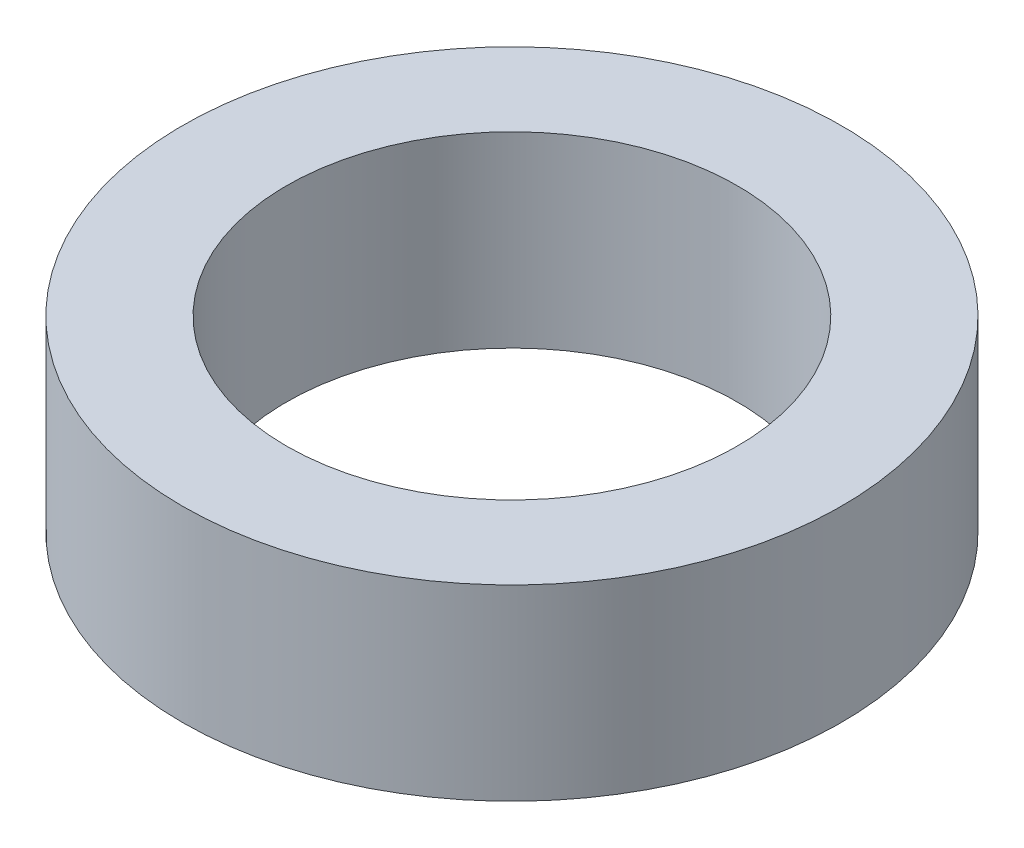
ISO-10303-21;
HEADER;
FILE_DESCRIPTION(('STEP AP214'),'2;1');
FILE_NAME('part.step','',(''),(''),'','','');
FILE_SCHEMA(('AUTOMOTIVE_DESIGN { 1 0 10303 214 1 1 1 1 }'));
ENDSEC;
DATA;
#1=APPLICATION_CONTEXT('core data for automotive mechanical design processes');
#2=APPLICATION_PROTOCOL_DEFINITION('international standard','automotive_design',2000,#1);
#3=PRODUCT_CONTEXT('',#1,'mechanical');
#4=PRODUCT('Part','Part','',(#3));
#5=PRODUCT_RELATED_PRODUCT_CATEGORY('part','',(#4));
#6=PRODUCT_DEFINITION_FORMATION('','',#4);
#7=PRODUCT_DEFINITION_CONTEXT('part definition',#1,'design');
#8=PRODUCT_DEFINITION('design','',#6,#7);
#9=PRODUCT_DEFINITION_SHAPE('','',#8);
#10=(LENGTH_UNIT() NAMED_UNIT(*) SI_UNIT(.MILLI.,.METRE.));
#11=(NAMED_UNIT(*) PLANE_ANGLE_UNIT() SI_UNIT($,.RADIAN.));
#12=(NAMED_UNIT(*) SI_UNIT($,.STERADIAN.) SOLID_ANGLE_UNIT());
#13=UNCERTAINTY_MEASURE_WITH_UNIT(LENGTH_MEASURE(1.E-05),#10,'distance_accuracy_value','');
#14=(GEOMETRIC_REPRESENTATION_CONTEXT(3) GLOBAL_UNCERTAINTY_ASSIGNED_CONTEXT((#13)) GLOBAL_UNIT_ASSIGNED_CONTEXT((#10,
#11,#12)) REPRESENTATION_CONTEXT('',''));
#15=CARTESIAN_POINT('',(0.,0.,0.));
#16=DIRECTION('',(0.,0.,1.));
#17=DIRECTION('',(1.,0.,0.));
#18=AXIS2_PLACEMENT_3D('',#15,#16,#17);
#19=CARTESIAN_POINT('',(0.,27.,0.));
#20=DIRECTION('',(0.,-1.,0.));
#21=DIRECTION('',(0.,0.,-1.));
#22=AXIS2_PLACEMENT_3D('',#19,#20,#21);
#23=CYLINDRICAL_SURFACE('',#22,47.5);
#24=CARTESIAN_POINT('',(0.,27.,0.));
#25=DIRECTION('',(0.,1.,0.));
#26=DIRECTION('',(0.,0.,1.));
#27=AXIS2_PLACEMENT_3D('',#24,#25,#26);
#28=CIRCLE('',#27,47.5);
#29=CARTESIAN_POINT('',(0.,27.,47.5));
#30=VERTEX_POINT('',#29);
#31=EDGE_CURVE('E10',#30,#30,#28,.T.);
#32=ORIENTED_EDGE('',*,*,#31,.F.);
#33=EDGE_LOOP('',(#32));
#34=FACE_BOUND('',#33,.T.);
#35=CARTESIAN_POINT('',(0.,0.,0.));
#36=DIRECTION('',(0.,1.,0.));
#37=DIRECTION('',(0.,0.,1.));
#38=AXIS2_PLACEMENT_3D('',#35,#36,#37);
#39=CIRCLE('',#38,47.5);
#40=CARTESIAN_POINT('',(0.,0.,47.5));
#41=VERTEX_POINT('',#40);
#42=EDGE_CURVE('E37',#41,#41,#39,.T.);
#43=ORIENTED_EDGE('',*,*,#42,.T.);
#44=EDGE_LOOP('',(#43));
#45=FACE_BOUND('',#44,.T.);
#46=ADVANCED_FACE('F40',(#34,#45),#23,.T.);
#47=CARTESIAN_POINT('',(0.,27.,0.));
#48=DIRECTION('',(0.,1.,0.));
#49=DIRECTION('',(0.,0.,1.));
#50=AXIS2_PLACEMENT_3D('',#47,#48,#49);
#51=PLANE('',#50);
#52=CARTESIAN_POINT('',(0.,27.,0.));
#53=DIRECTION('',(0.,1.,0.));
#54=DIRECTION('',(0.,0.,1.));
#55=AXIS2_PLACEMENT_3D('',#52,#53,#54);
#56=CIRCLE('',#55,32.5);
#57=CARTESIAN_POINT('',(0.,27.,32.5));
#58=VERTEX_POINT('',#57);
#59=EDGE_CURVE('E50',#58,#58,#56,.T.);
#60=ORIENTED_EDGE('',*,*,#59,.F.);
#61=EDGE_LOOP('',(#60));
#62=FACE_BOUND('',#61,.T.);
#63=ORIENTED_EDGE('',*,*,#31,.T.);
#64=EDGE_LOOP('',(#63));
#65=FACE_BOUND('',#64,.T.);
#66=ADVANCED_FACE('F59',(#62,#65),#51,.T.);
#67=CARTESIAN_POINT('',(0.,0.,0.));
#68=DIRECTION('',(0.,1.,0.));
#69=DIRECTION('',(0.,0.,1.));
#70=AXIS2_PLACEMENT_3D('',#67,#68,#69);
#71=PLANE('',#70);
#72=CARTESIAN_POINT('',(0.,0.,0.));
#73=DIRECTION('',(0.,1.,0.));
#74=DIRECTION('',(0.,0.,1.));
#75=AXIS2_PLACEMENT_3D('',#72,#73,#74);
#76=CIRCLE('',#75,32.5);
#77=CARTESIAN_POINT('',(0.,0.,32.5));
#78=VERTEX_POINT('',#77);
#79=EDGE_CURVE('E47',#78,#78,#76,.T.);
#80=ORIENTED_EDGE('',*,*,#79,.T.);
#81=EDGE_LOOP('',(#80));
#82=FACE_BOUND('',#81,.T.);
#83=ORIENTED_EDGE('',*,*,#42,.F.);
#84=EDGE_LOOP('',(#83));
#85=FACE_BOUND('',#84,.T.);
#86=ADVANCED_FACE('F58',(#82,#85),#71,.F.);
#87=CARTESIAN_POINT('',(0.,27.,0.));
#88=DIRECTION('',(0.,-1.,0.));
#89=DIRECTION('',(0.,0.,-1.));
#90=AXIS2_PLACEMENT_3D('',#87,#88,#89);
#91=CYLINDRICAL_SURFACE('',#90,32.5);
#92=ORIENTED_EDGE('',*,*,#59,.T.);
#93=EDGE_LOOP('',(#92));
#94=FACE_BOUND('',#93,.T.);
#95=ORIENTED_EDGE('',*,*,#79,.F.);
#96=EDGE_LOOP('',(#95));
#97=FACE_BOUND('',#96,.T.);
#98=ADVANCED_FACE('F54',(#94,#97),#91,.F.);
#99=CLOSED_SHELL('',(#46,#66,#86,#98));
#100=MANIFOLD_SOLID_BREP('B2',#99);
#101=ADVANCED_BREP_SHAPE_REPRESENTATION('',(#18,#100),#14);
#102=SHAPE_DEFINITION_REPRESENTATION(#9,#101);
ENDSEC;
END-ISO-10303-21;
